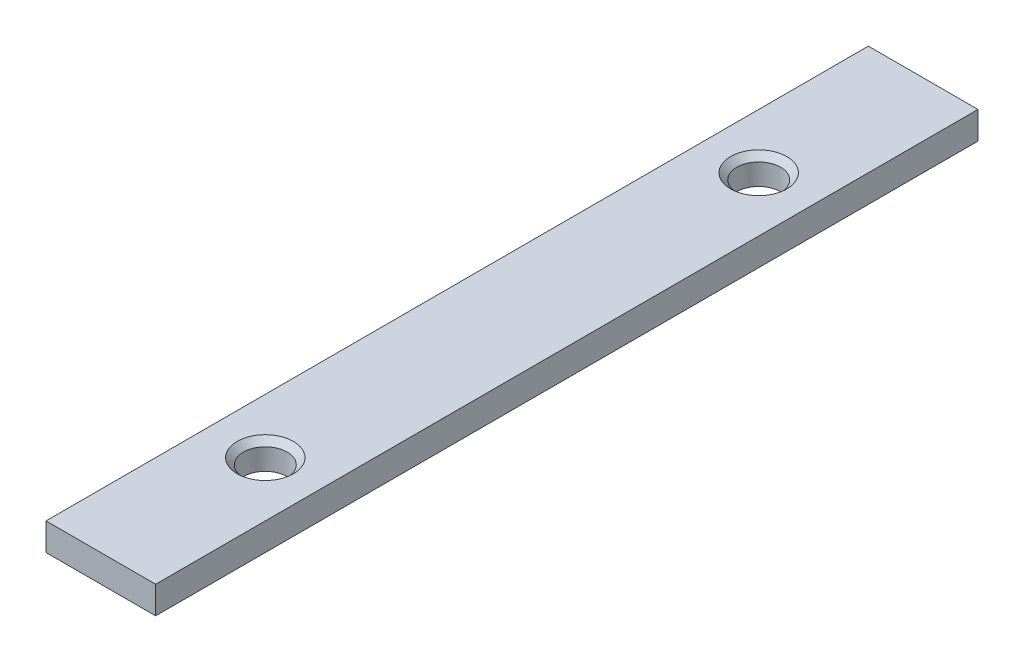
ISO-10303-21;
HEADER;
FILE_DESCRIPTION(('STEP AP214'),'2;1');
FILE_NAME('part.step','',(''),(''),'','','');
FILE_SCHEMA(('AUTOMOTIVE_DESIGN { 1 0 10303 214 1 1 1 1 }'));
ENDSEC;
DATA;
#1=APPLICATION_CONTEXT('core data for automotive mechanical design processes');
#2=APPLICATION_PROTOCOL_DEFINITION('international standard','automotive_design',2000,#1);
#3=PRODUCT_CONTEXT('',#1,'mechanical');
#4=PRODUCT('Part','Part','',(#3));
#5=PRODUCT_RELATED_PRODUCT_CATEGORY('part','',(#4));
#6=PRODUCT_DEFINITION_FORMATION('','',#4);
#7=PRODUCT_DEFINITION_CONTEXT('part definition',#1,'design');
#8=PRODUCT_DEFINITION('design','',#6,#7);
#9=PRODUCT_DEFINITION_SHAPE('','',#8);
#10=(LENGTH_UNIT() NAMED_UNIT(*) SI_UNIT(.MILLI.,.METRE.));
#11=(NAMED_UNIT(*) PLANE_ANGLE_UNIT() SI_UNIT($,.RADIAN.));
#12=(NAMED_UNIT(*) SI_UNIT($,.STERADIAN.) SOLID_ANGLE_UNIT());
#13=UNCERTAINTY_MEASURE_WITH_UNIT(LENGTH_MEASURE(1.E-05),#10,'distance_accuracy_value','');
#14=(GEOMETRIC_REPRESENTATION_CONTEXT(3) GLOBAL_UNCERTAINTY_ASSIGNED_CONTEXT((#13)) GLOBAL_UNIT_ASSIGNED_CONTEXT((#10,
#11,#12)) REPRESENTATION_CONTEXT('',''));
#15=CARTESIAN_POINT('',(0.,0.,0.));
#16=DIRECTION('',(0.,0.,1.));
#17=DIRECTION('',(1.,0.,0.));
#18=AXIS2_PLACEMENT_3D('',#15,#16,#17);
#19=CARTESIAN_POINT('',(0.,1.,0.));
#20=DIRECTION('',(1.,0.,0.));
#21=DIRECTION('',(0.,0.,-1.));
#22=AXIS2_PLACEMENT_3D('',#19,#20,#21);
#23=PLANE('',#22);
#24=DIRECTION('',(0.,0.,1.));
#25=VECTOR('',#24,1.);
#26=CARTESIAN_POINT('',(0.,0.,0.));
#27=LINE('',#26,#25);
#28=CARTESIAN_POINT('',(0.,0.,-30.));
#29=VERTEX_POINT('',#28);
#30=CARTESIAN_POINT('',(0.,0.,0.));
#31=VERTEX_POINT('',#30);
#32=EDGE_CURVE('E102',#29,#31,#27,.T.);
#33=ORIENTED_EDGE('',*,*,#32,.T.);
#34=DIRECTION('',(0.,-1.,0.));
#35=VECTOR('',#34,1.);
#36=CARTESIAN_POINT('',(0.,1.,0.));
#37=LINE('',#36,#35);
#38=CARTESIAN_POINT('',(0.,1.,0.));
#39=VERTEX_POINT('',#38);
#40=EDGE_CURVE('E11',#39,#31,#37,.T.);
#41=ORIENTED_EDGE('',*,*,#40,.F.);
#42=DIRECTION('',(0.,0.,1.));
#43=VECTOR('',#42,1.);
#44=CARTESIAN_POINT('',(0.,1.,0.));
#45=LINE('',#44,#43);
#46=CARTESIAN_POINT('',(0.,1.,-30.));
#47=VERTEX_POINT('',#46);
#48=EDGE_CURVE('E89',#47,#39,#45,.T.);
#49=ORIENTED_EDGE('',*,*,#48,.F.);
#50=DIRECTION('',(0.,-1.,0.));
#51=VECTOR('',#50,1.);
#52=CARTESIAN_POINT('',(0.,1.,-30.));
#53=LINE('',#52,#51);
#54=EDGE_CURVE('E98',#47,#29,#53,.T.);
#55=ORIENTED_EDGE('',*,*,#54,.T.);
#56=EDGE_LOOP('',(#33,#41,#49,#55));
#57=FACE_BOUND('',#56,.T.);
#58=ADVANCED_FACE('F36',(#57),#23,.F.);
#59=CARTESIAN_POINT('',(0.,1.,0.));
#60=DIRECTION('',(0.,0.,-1.));
#61=DIRECTION('',(-1.,0.,0.));
#62=AXIS2_PLACEMENT_3D('',#59,#60,#61);
#63=PLANE('',#62);
#64=DIRECTION('',(1.,0.,0.));
#65=VECTOR('',#64,1.);
#66=CARTESIAN_POINT('',(0.,0.,0.));
#67=LINE('',#66,#65);
#68=CARTESIAN_POINT('',(4.,0.,0.));
#69=VERTEX_POINT('',#68);
#70=EDGE_CURVE('E93',#31,#69,#67,.T.);
#71=ORIENTED_EDGE('',*,*,#70,.T.);
#72=DIRECTION('',(0.,-1.,0.));
#73=VECTOR('',#72,1.);
#74=CARTESIAN_POINT('',(4.,1.,0.));
#75=LINE('',#74,#73);
#76=CARTESIAN_POINT('',(4.,1.,0.));
#77=VERTEX_POINT('',#76);
#78=EDGE_CURVE('E45',#77,#69,#75,.T.);
#79=ORIENTED_EDGE('',*,*,#78,.F.);
#80=DIRECTION('',(1.,0.,0.));
#81=VECTOR('',#80,1.);
#82=CARTESIAN_POINT('',(0.,1.,0.));
#83=LINE('',#82,#81);
#84=EDGE_CURVE('E84',#39,#77,#83,.T.);
#85=ORIENTED_EDGE('',*,*,#84,.F.);
#86=ORIENTED_EDGE('',*,*,#40,.T.);
#87=EDGE_LOOP('',(#71,#79,#85,#86));
#88=FACE_BOUND('',#87,.T.);
#89=ADVANCED_FACE('F92',(#88),#63,.F.);
#90=CARTESIAN_POINT('',(4.,1.,0.));
#91=DIRECTION('',(-1.,0.,0.));
#92=DIRECTION('',(0.,0.,1.));
#93=AXIS2_PLACEMENT_3D('',#90,#91,#92);
#94=PLANE('',#93);
#95=DIRECTION('',(0.,0.,-1.));
#96=VECTOR('',#95,1.);
#97=CARTESIAN_POINT('',(4.,0.,0.));
#98=LINE('',#97,#96);
#99=CARTESIAN_POINT('',(4.,0.,-30.));
#100=VERTEX_POINT('',#99);
#101=EDGE_CURVE('E71',#69,#100,#98,.T.);
#102=ORIENTED_EDGE('',*,*,#101,.T.);
#103=DIRECTION('',(0.,-1.,0.));
#104=VECTOR('',#103,1.);
#105=CARTESIAN_POINT('',(4.,1.,-30.));
#106=LINE('',#105,#104);
#107=CARTESIAN_POINT('',(4.,1.,-30.));
#108=VERTEX_POINT('',#107);
#109=EDGE_CURVE('E94',#108,#100,#106,.T.);
#110=ORIENTED_EDGE('',*,*,#109,.F.);
#111=DIRECTION('',(0.,0.,-1.));
#112=VECTOR('',#111,1.);
#113=CARTESIAN_POINT('',(4.,1.,0.));
#114=LINE('',#113,#112);
#115=EDGE_CURVE('E87',#77,#108,#114,.T.);
#116=ORIENTED_EDGE('',*,*,#115,.F.);
#117=ORIENTED_EDGE('',*,*,#78,.T.);
#118=EDGE_LOOP('',(#102,#110,#116,#117));
#119=FACE_BOUND('',#118,.T.);
#120=ADVANCED_FACE('F96',(#119),#94,.F.);
#121=CARTESIAN_POINT('',(0.,1.,-30.));
#122=DIRECTION('',(0.,0.,1.));
#123=DIRECTION('',(1.,0.,0.));
#124=AXIS2_PLACEMENT_3D('',#121,#122,#123);
#125=PLANE('',#124);
#126=DIRECTION('',(-1.,0.,0.));
#127=VECTOR('',#126,1.);
#128=CARTESIAN_POINT('',(0.,0.,-30.));
#129=LINE('',#128,#127);
#130=EDGE_CURVE('E77',#100,#29,#129,.T.);
#131=ORIENTED_EDGE('',*,*,#130,.T.);
#132=ORIENTED_EDGE('',*,*,#54,.F.);
#133=DIRECTION('',(-1.,0.,0.));
#134=VECTOR('',#133,1.);
#135=CARTESIAN_POINT('',(0.,1.,-30.));
#136=LINE('',#135,#134);
#137=EDGE_CURVE('E54',#108,#47,#136,.T.);
#138=ORIENTED_EDGE('',*,*,#137,.F.);
#139=ORIENTED_EDGE('',*,*,#109,.T.);
#140=EDGE_LOOP('',(#131,#132,#138,#139));
#141=FACE_BOUND('',#140,.T.);
#142=ADVANCED_FACE('F134',(#141),#125,.F.);
#143=CARTESIAN_POINT('',(0.,1.,0.));
#144=DIRECTION('',(0.,-1.,0.));
#145=DIRECTION('',(0.,0.,-1.));
#146=AXIS2_PLACEMENT_3D('',#143,#144,#145);
#147=PLANE('',#146);
#148=CARTESIAN_POINT('',(2.,1.,-24.));
#149=DIRECTION('',(0.,1.,0.));
#150=DIRECTION('',(0.,0.,1.));
#151=AXIS2_PLACEMENT_3D('',#148,#149,#150);
#152=CIRCLE('',#151,1.025);
#153=CARTESIAN_POINT('',(2.,1.,-22.975));
#154=VERTEX_POINT('',#153);
#155=EDGE_CURVE('E125',#154,#154,#152,.T.);
#156=ORIENTED_EDGE('',*,*,#155,.F.);
#157=EDGE_LOOP('',(#156));
#158=FACE_BOUND('',#157,.T.);
#159=CARTESIAN_POINT('',(2.,1.,-6.));
#160=DIRECTION('',(0.,1.,0.));
#161=DIRECTION('',(0.,0.,1.));
#162=AXIS2_PLACEMENT_3D('',#159,#160,#161);
#163=CIRCLE('',#162,1.025);
#164=CARTESIAN_POINT('',(2.,1.,-4.975));
#165=VERTEX_POINT('',#164);
#166=EDGE_CURVE('E115',#165,#165,#163,.T.);
#167=ORIENTED_EDGE('',*,*,#166,.F.);
#168=EDGE_LOOP('',(#167));
#169=FACE_BOUND('',#168,.T.);
#170=ORIENTED_EDGE('',*,*,#48,.T.);
#171=ORIENTED_EDGE('',*,*,#84,.T.);
#172=ORIENTED_EDGE('',*,*,#115,.T.);
#173=ORIENTED_EDGE('',*,*,#137,.T.);
#174=EDGE_LOOP('',(#170,#171,#172,#173));
#175=FACE_BOUND('',#174,.T.);
#176=ADVANCED_FACE('F85',(#158,#169,#175),#147,.F.);
#177=CARTESIAN_POINT('',(0.,0.,0.));
#178=DIRECTION('',(0.,-1.,0.));
#179=DIRECTION('',(0.,0.,-1.));
#180=AXIS2_PLACEMENT_3D('',#177,#178,#179);
#181=PLANE('',#180);
#182=CARTESIAN_POINT('',(2.,0.,-24.));
#183=DIRECTION('',(0.,-1.,0.));
#184=DIRECTION('',(0.,0.,-1.));
#185=AXIS2_PLACEMENT_3D('',#182,#183,#184);
#186=CIRCLE('',#185,0.799999999999989);
#187=CARTESIAN_POINT('',(2.,0.,-24.8));
#188=VERTEX_POINT('',#187);
#189=EDGE_CURVE('E39',#188,#188,#186,.T.);
#190=ORIENTED_EDGE('',*,*,#189,.F.);
#191=EDGE_LOOP('',(#190));
#192=FACE_BOUND('',#191,.T.);
#193=CARTESIAN_POINT('',(2.,0.,-6.));
#194=DIRECTION('',(0.,-1.,0.));
#195=DIRECTION('',(0.,0.,-1.));
#196=AXIS2_PLACEMENT_3D('',#193,#194,#195);
#197=CIRCLE('',#196,0.799999999999989);
#198=CARTESIAN_POINT('',(2.,0.,-6.79999999999999));
#199=VERTEX_POINT('',#198);
#200=EDGE_CURVE('E105',#199,#199,#197,.T.);
#201=ORIENTED_EDGE('',*,*,#200,.F.);
#202=EDGE_LOOP('',(#201));
#203=FACE_BOUND('',#202,.T.);
#204=ORIENTED_EDGE('',*,*,#32,.F.);
#205=ORIENTED_EDGE('',*,*,#130,.F.);
#206=ORIENTED_EDGE('',*,*,#101,.F.);
#207=ORIENTED_EDGE('',*,*,#70,.F.);
#208=EDGE_LOOP('',(#204,#205,#206,#207));
#209=FACE_BOUND('',#208,.T.);
#210=ADVANCED_FACE('F133',(#192,#203,#209),#181,.T.);
#211=CARTESIAN_POINT('',(2.,1.,-6.));
#212=DIRECTION('',(0.,1.,0.));
#213=DIRECTION('',(0.,0.,1.));
#214=AXIS2_PLACEMENT_3D('',#211,#212,#213);
#215=CYLINDRICAL_SURFACE('',#214,0.799999999999989);
#216=ORIENTED_EDGE('',*,*,#200,.T.);
#217=EDGE_LOOP('',(#216));
#218=FACE_BOUND('',#217,.T.);
#219=CARTESIAN_POINT('',(2.,0.774999999999997,-6.));
#220=DIRECTION('',(0.,1.,0.));
#221=DIRECTION('',(0.,0.,1.));
#222=AXIS2_PLACEMENT_3D('',#219,#220,#221);
#223=CIRCLE('',#222,0.79999999999999);
#224=CARTESIAN_POINT('',(2.,0.774999999999997,-5.20000000000001));
#225=VERTEX_POINT('',#224);
#226=EDGE_CURVE('E111',#225,#225,#223,.T.);
#227=ORIENTED_EDGE('',*,*,#226,.T.);
#228=EDGE_LOOP('',(#227));
#229=FACE_BOUND('',#228,.T.);
#230=ADVANCED_FACE('F141',(#218,#229),#215,.F.);
#231=CARTESIAN_POINT('',(2.,1.,-6.));
#232=DIRECTION('',(0.,1.,0.));
#233=DIRECTION('',(0.,0.,1.));
#234=AXIS2_PLACEMENT_3D('',#231,#232,#233);
#235=CONICAL_SURFACE('',#234,1.025,0.78539816339746);
#236=ORIENTED_EDGE('',*,*,#226,.F.);
#237=EDGE_LOOP('',(#236));
#238=FACE_BOUND('',#237,.T.);
#239=ORIENTED_EDGE('',*,*,#166,.T.);
#240=EDGE_LOOP('',(#239));
#241=FACE_BOUND('',#240,.T.);
#242=ADVANCED_FACE('F138',(#238,#241),#235,.F.);
#243=CARTESIAN_POINT('',(2.,1.,-24.));
#244=DIRECTION('',(0.,1.,0.));
#245=DIRECTION('',(0.,0.,1.));
#246=AXIS2_PLACEMENT_3D('',#243,#244,#245);
#247=CYLINDRICAL_SURFACE('',#246,0.799999999999989);
#248=ORIENTED_EDGE('',*,*,#189,.T.);
#249=EDGE_LOOP('',(#248));
#250=FACE_BOUND('',#249,.T.);
#251=CARTESIAN_POINT('',(2.,0.774999999999997,-24.));
#252=DIRECTION('',(0.,1.,0.));
#253=DIRECTION('',(0.,0.,1.));
#254=AXIS2_PLACEMENT_3D('',#251,#252,#253);
#255=CIRCLE('',#254,0.79999999999999);
#256=CARTESIAN_POINT('',(2.,0.774999999999997,-23.2));
#257=VERTEX_POINT('',#256);
#258=EDGE_CURVE('E122',#257,#257,#255,.T.);
#259=ORIENTED_EDGE('',*,*,#258,.T.);
#260=EDGE_LOOP('',(#259));
#261=FACE_BOUND('',#260,.T.);
#262=ADVANCED_FACE('F140',(#250,#261),#247,.F.);
#263=CARTESIAN_POINT('',(2.,1.,-24.));
#264=DIRECTION('',(0.,1.,0.));
#265=DIRECTION('',(0.,0.,1.));
#266=AXIS2_PLACEMENT_3D('',#263,#264,#265);
#267=CONICAL_SURFACE('',#266,1.025,0.78539816339746);
#268=ORIENTED_EDGE('',*,*,#258,.F.);
#269=EDGE_LOOP('',(#268));
#270=FACE_BOUND('',#269,.T.);
#271=ORIENTED_EDGE('',*,*,#155,.T.);
#272=EDGE_LOOP('',(#271));
#273=FACE_BOUND('',#272,.T.);
#274=ADVANCED_FACE('F129',(#270,#273),#267,.F.);
#275=CLOSED_SHELL('',(#58,#89,#120,#142,#176,#210,#230,#242,#262,#274));
#276=MANIFOLD_SOLID_BREP('B2',#275);
#277=ADVANCED_BREP_SHAPE_REPRESENTATION('',(#18,#276),#14);
#278=SHAPE_DEFINITION_REPRESENTATION(#9,#277);
ENDSEC;
END-ISO-10303-21;
